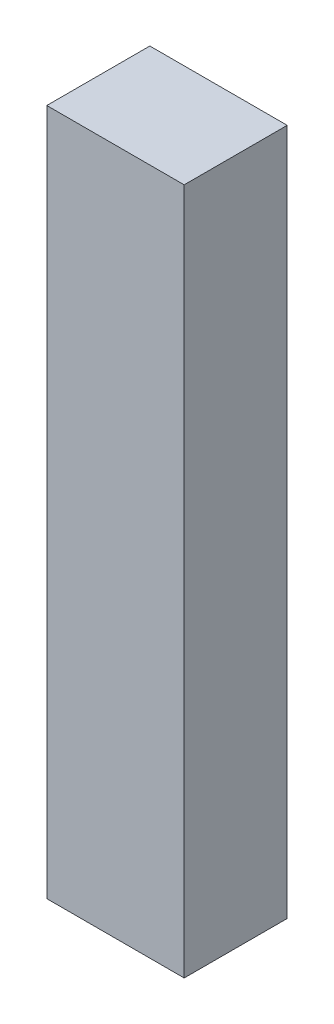
ISO-10303-21;
HEADER;
FILE_DESCRIPTION(('STEP AP214'),'2;1');
FILE_NAME('part.step','',(''),(''),'','','');
FILE_SCHEMA(('AUTOMOTIVE_DESIGN { 1 0 10303 214 1 1 1 1 }'));
ENDSEC;
DATA;
#1=APPLICATION_CONTEXT('core data for automotive mechanical design processes');
#2=APPLICATION_PROTOCOL_DEFINITION('international standard','automotive_design',2000,#1);
#3=PRODUCT_CONTEXT('',#1,'mechanical');
#4=PRODUCT('Part','Part','',(#3));
#5=PRODUCT_RELATED_PRODUCT_CATEGORY('part','',(#4));
#6=PRODUCT_DEFINITION_FORMATION('','',#4);
#7=PRODUCT_DEFINITION_CONTEXT('part definition',#1,'design');
#8=PRODUCT_DEFINITION('design','',#6,#7);
#9=PRODUCT_DEFINITION_SHAPE('','',#8);
#10=(LENGTH_UNIT() NAMED_UNIT(*) SI_UNIT(.MILLI.,.METRE.));
#11=(NAMED_UNIT(*) PLANE_ANGLE_UNIT() SI_UNIT($,.RADIAN.));
#12=(NAMED_UNIT(*) SI_UNIT($,.STERADIAN.) SOLID_ANGLE_UNIT());
#13=UNCERTAINTY_MEASURE_WITH_UNIT(LENGTH_MEASURE(1.E-05),#10,'distance_accuracy_value','');
#14=(GEOMETRIC_REPRESENTATION_CONTEXT(3) GLOBAL_UNCERTAINTY_ASSIGNED_CONTEXT((#13)) GLOBAL_UNIT_ASSIGNED_CONTEXT((#10,
#11,#12)) REPRESENTATION_CONTEXT('',''));
#15=CARTESIAN_POINT('',(0.,0.,0.));
#16=DIRECTION('',(0.,0.,1.));
#17=DIRECTION('',(1.,0.,0.));
#18=AXIS2_PLACEMENT_3D('',#15,#16,#17);
#19=CARTESIAN_POINT('',(200.,2000.,-150.));
#20=DIRECTION('',(-1.,0.,0.));
#21=DIRECTION('',(0.,0.,1.));
#22=AXIS2_PLACEMENT_3D('',#19,#20,#21);
#23=PLANE('',#22);
#24=DIRECTION('',(0.,0.,-1.));
#25=VECTOR('',#24,1.);
#26=CARTESIAN_POINT('',(200.,0.,-150.));
#27=LINE('',#26,#25);
#28=CARTESIAN_POINT('',(200.,0.,150.));
#29=VERTEX_POINT('',#28);
#30=CARTESIAN_POINT('',(200.,0.,-150.));
#31=VERTEX_POINT('',#30);
#32=EDGE_CURVE('E98',#29,#31,#27,.T.);
#33=ORIENTED_EDGE('',*,*,#32,.T.);
#34=DIRECTION('',(0.,-1.,0.));
#35=VECTOR('',#34,1.);
#36=CARTESIAN_POINT('',(200.,2000.,-150.));
#37=LINE('',#36,#35);
#38=CARTESIAN_POINT('',(200.,2000.,-150.));
#39=VERTEX_POINT('',#38);
#40=EDGE_CURVE('E11',#39,#31,#37,.T.);
#41=ORIENTED_EDGE('',*,*,#40,.F.);
#42=DIRECTION('',(0.,0.,-1.));
#43=VECTOR('',#42,1.);
#44=CARTESIAN_POINT('',(200.,2000.,-150.));
#45=LINE('',#44,#43);
#46=CARTESIAN_POINT('',(200.,2000.,150.));
#47=VERTEX_POINT('',#46);
#48=EDGE_CURVE('E86',#47,#39,#45,.T.);
#49=ORIENTED_EDGE('',*,*,#48,.F.);
#50=DIRECTION('',(0.,-1.,0.));
#51=VECTOR('',#50,1.);
#52=CARTESIAN_POINT('',(200.,2000.,150.));
#53=LINE('',#52,#51);
#54=EDGE_CURVE('E94',#47,#29,#53,.T.);
#55=ORIENTED_EDGE('',*,*,#54,.T.);
#56=EDGE_LOOP('',(#33,#41,#49,#55));
#57=FACE_BOUND('',#56,.T.);
#58=ADVANCED_FACE('F35',(#57),#23,.F.);
#59=CARTESIAN_POINT('',(-200.,2000.,-150.));
#60=DIRECTION('',(0.,0.,1.));
#61=DIRECTION('',(1.,0.,0.));
#62=AXIS2_PLACEMENT_3D('',#59,#60,#61);
#63=PLANE('',#62);
#64=DIRECTION('',(-1.,0.,0.));
#65=VECTOR('',#64,1.);
#66=CARTESIAN_POINT('',(-200.,0.,-150.));
#67=LINE('',#66,#65);
#68=CARTESIAN_POINT('',(-200.,0.,-150.));
#69=VERTEX_POINT('',#68);
#70=EDGE_CURVE('E90',#31,#69,#67,.T.);
#71=ORIENTED_EDGE('',*,*,#70,.T.);
#72=DIRECTION('',(0.,-1.,0.));
#73=VECTOR('',#72,1.);
#74=CARTESIAN_POINT('',(-200.,2000.,-150.));
#75=LINE('',#74,#73);
#76=CARTESIAN_POINT('',(-200.,2000.,-150.));
#77=VERTEX_POINT('',#76);
#78=EDGE_CURVE('E43',#77,#69,#75,.T.);
#79=ORIENTED_EDGE('',*,*,#78,.F.);
#80=DIRECTION('',(-1.,0.,0.));
#81=VECTOR('',#80,1.);
#82=CARTESIAN_POINT('',(-200.,2000.,-150.));
#83=LINE('',#82,#81);
#84=EDGE_CURVE('E81',#39,#77,#83,.T.);
#85=ORIENTED_EDGE('',*,*,#84,.F.);
#86=ORIENTED_EDGE('',*,*,#40,.T.);
#87=EDGE_LOOP('',(#71,#79,#85,#86));
#88=FACE_BOUND('',#87,.T.);
#89=ADVANCED_FACE('F89',(#88),#63,.F.);
#90=CARTESIAN_POINT('',(-200.,2000.,-150.));
#91=DIRECTION('',(1.,0.,0.));
#92=DIRECTION('',(0.,0.,-1.));
#93=AXIS2_PLACEMENT_3D('',#90,#91,#92);
#94=PLANE('',#93);
#95=DIRECTION('',(0.,0.,1.));
#96=VECTOR('',#95,1.);
#97=CARTESIAN_POINT('',(-200.,0.,-150.));
#98=LINE('',#97,#96);
#99=CARTESIAN_POINT('',(-200.,0.,150.));
#100=VERTEX_POINT('',#99);
#101=EDGE_CURVE('E68',#69,#100,#98,.T.);
#102=ORIENTED_EDGE('',*,*,#101,.T.);
#103=DIRECTION('',(0.,-1.,0.));
#104=VECTOR('',#103,1.);
#105=CARTESIAN_POINT('',(-200.,2000.,150.));
#106=LINE('',#105,#104);
#107=CARTESIAN_POINT('',(-200.,2000.,150.));
#108=VERTEX_POINT('',#107);
#109=EDGE_CURVE('E91',#108,#100,#106,.T.);
#110=ORIENTED_EDGE('',*,*,#109,.F.);
#111=DIRECTION('',(0.,0.,1.));
#112=VECTOR('',#111,1.);
#113=CARTESIAN_POINT('',(-200.,2000.,-150.));
#114=LINE('',#113,#112);
#115=EDGE_CURVE('E84',#77,#108,#114,.T.);
#116=ORIENTED_EDGE('',*,*,#115,.F.);
#117=ORIENTED_EDGE('',*,*,#78,.T.);
#118=EDGE_LOOP('',(#102,#110,#116,#117));
#119=FACE_BOUND('',#118,.T.);
#120=ADVANCED_FACE('F92',(#119),#94,.F.);
#121=CARTESIAN_POINT('',(-200.,2000.,150.));
#122=DIRECTION('',(0.,0.,-1.));
#123=DIRECTION('',(-1.,0.,0.));
#124=AXIS2_PLACEMENT_3D('',#121,#122,#123);
#125=PLANE('',#124);
#126=DIRECTION('',(1.,0.,0.));
#127=VECTOR('',#126,1.);
#128=CARTESIAN_POINT('',(-200.,0.,150.));
#129=LINE('',#128,#127);
#130=EDGE_CURVE('E74',#100,#29,#129,.T.);
#131=ORIENTED_EDGE('',*,*,#130,.T.);
#132=ORIENTED_EDGE('',*,*,#54,.F.);
#133=DIRECTION('',(1.,0.,0.));
#134=VECTOR('',#133,1.);
#135=CARTESIAN_POINT('',(-200.,2000.,150.));
#136=LINE('',#135,#134);
#137=EDGE_CURVE('E51',#108,#47,#136,.T.);
#138=ORIENTED_EDGE('',*,*,#137,.F.);
#139=ORIENTED_EDGE('',*,*,#109,.T.);
#140=EDGE_LOOP('',(#131,#132,#138,#139));
#141=FACE_BOUND('',#140,.T.);
#142=ADVANCED_FACE('F105',(#141),#125,.F.);
#143=CARTESIAN_POINT('',(0.,2000.,0.));
#144=DIRECTION('',(0.,1.,0.));
#145=DIRECTION('',(0.,0.,1.));
#146=AXIS2_PLACEMENT_3D('',#143,#144,#145);
#147=PLANE('',#146);
#148=ORIENTED_EDGE('',*,*,#48,.T.);
#149=ORIENTED_EDGE('',*,*,#84,.T.);
#150=ORIENTED_EDGE('',*,*,#115,.T.);
#151=ORIENTED_EDGE('',*,*,#137,.T.);
#152=EDGE_LOOP('',(#148,#149,#150,#151));
#153=FACE_BOUND('',#152,.T.);
#154=ADVANCED_FACE('F82',(#153),#147,.T.);
#155=CARTESIAN_POINT('',(0.,0.,0.));
#156=DIRECTION('',(0.,1.,0.));
#157=DIRECTION('',(0.,0.,1.));
#158=AXIS2_PLACEMENT_3D('',#155,#156,#157);
#159=PLANE('',#158);
#160=ORIENTED_EDGE('',*,*,#32,.F.);
#161=ORIENTED_EDGE('',*,*,#130,.F.);
#162=ORIENTED_EDGE('',*,*,#101,.F.);
#163=ORIENTED_EDGE('',*,*,#70,.F.);
#164=EDGE_LOOP('',(#160,#161,#162,#163));
#165=FACE_BOUND('',#164,.T.);
#166=ADVANCED_FACE('F108',(#165),#159,.F.);
#167=CLOSED_SHELL('',(#58,#89,#120,#142,#154,#166));
#168=MANIFOLD_SOLID_BREP('B2',#167);
#169=ADVANCED_BREP_SHAPE_REPRESENTATION('',(#18,#168),#14);
#170=SHAPE_DEFINITION_REPRESENTATION(#9,#169);
ENDSEC;
END-ISO-10303-21;
